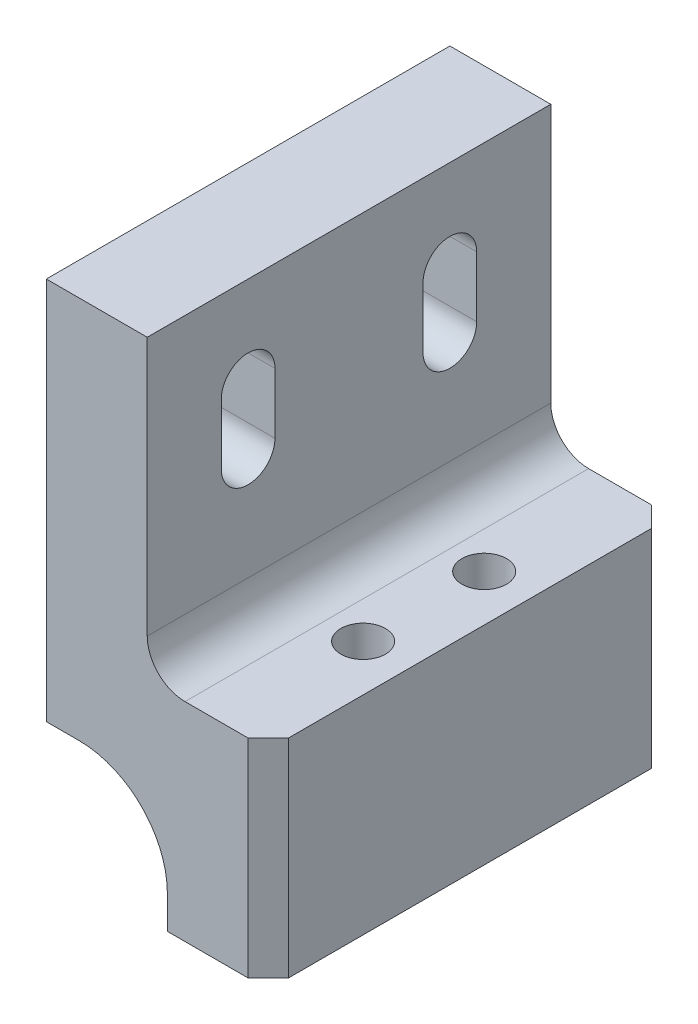
ISO-10303-21;
HEADER;
FILE_DESCRIPTION(('STEP AP214'),'2;1');
FILE_NAME('part.step','',(''),(''),'','','');
FILE_SCHEMA(('AUTOMOTIVE_DESIGN { 1 0 10303 214 1 1 1 1 }'));
ENDSEC;
DATA;
#1=APPLICATION_CONTEXT('core data for automotive mechanical design processes');
#2=APPLICATION_PROTOCOL_DEFINITION('international standard','automotive_design',2000,#1);
#3=PRODUCT_CONTEXT('',#1,'mechanical');
#4=PRODUCT('Part','Part','',(#3));
#5=PRODUCT_RELATED_PRODUCT_CATEGORY('part','',(#4));
#6=PRODUCT_DEFINITION_FORMATION('','',#4);
#7=PRODUCT_DEFINITION_CONTEXT('part definition',#1,'design');
#8=PRODUCT_DEFINITION('design','',#6,#7);
#9=PRODUCT_DEFINITION_SHAPE('','',#8);
#10=(LENGTH_UNIT() NAMED_UNIT(*) SI_UNIT(.MILLI.,.METRE.));
#11=(NAMED_UNIT(*) PLANE_ANGLE_UNIT() SI_UNIT($,.RADIAN.));
#12=(NAMED_UNIT(*) SI_UNIT($,.STERADIAN.) SOLID_ANGLE_UNIT());
#13=UNCERTAINTY_MEASURE_WITH_UNIT(LENGTH_MEASURE(1.E-05),#10,'distance_accuracy_value','');
#14=(GEOMETRIC_REPRESENTATION_CONTEXT(3) GLOBAL_UNCERTAINTY_ASSIGNED_CONTEXT((#13)) GLOBAL_UNIT_ASSIGNED_CONTEXT((#10,
#11,#12)) REPRESENTATION_CONTEXT('',''));
#15=CARTESIAN_POINT('',(0.,0.,0.));
#16=DIRECTION('',(0.,0.,1.));
#17=DIRECTION('',(1.,0.,0.));
#18=AXIS2_PLACEMENT_3D('',#15,#16,#17);
#19=CARTESIAN_POINT('',(27.94,31.7500000000001,-25.4));
#20=DIRECTION('',(0.,0.999999999999999,0.));
#21=DIRECTION('',(0.,0.,0.999999999999998));
#22=AXIS2_PLACEMENT_3D('',#19,#20,#21);
#23=PLANE('',#22);
#24=DIRECTION('',(0.,0.,0.999999999999998));
#25=VECTOR('',#24,1.);
#26=CARTESIAN_POINT('',(12.7,31.7500000000001,-25.4));
#27=LINE('',#26,#25);
#28=CARTESIAN_POINT('',(12.7,31.7500000000001,-25.4));
#29=VERTEX_POINT('',#28);
#30=CARTESIAN_POINT('',(12.7,31.75,25.3999999999997));
#31=VERTEX_POINT('',#30);
#32=EDGE_CURVE('E260',#29,#31,#27,.T.);
#33=ORIENTED_EDGE('',*,*,#32,.F.);
#34=DIRECTION('',(-1.,0.,0.));
#35=VECTOR('',#34,1.);
#36=CARTESIAN_POINT('',(27.94,31.7500000000001,-25.4));
#37=LINE('',#36,#35);
#38=CARTESIAN_POINT('',(0.,31.7499999999999,-25.4));
#39=VERTEX_POINT('',#38);
#40=EDGE_CURVE('E304',#29,#39,#37,.T.);
#41=ORIENTED_EDGE('',*,*,#40,.T.);
#42=DIRECTION('',(0.,0.,0.999999999999998));
#43=VECTOR('',#42,1.);
#44=CARTESIAN_POINT('',(0.,31.7499999999999,-25.4));
#45=LINE('',#44,#43);
#46=CARTESIAN_POINT('',(0.,31.75,25.3999999999997));
#47=VERTEX_POINT('',#46);
#48=EDGE_CURVE('E290',#39,#47,#45,.T.);
#49=ORIENTED_EDGE('',*,*,#48,.T.);
#50=DIRECTION('',(-1.,0.,0.));
#51=VECTOR('',#50,1.);
#52=CARTESIAN_POINT('',(27.94,31.75,25.3999999999997));
#53=LINE('',#52,#51);
#54=EDGE_CURVE('E300',#31,#47,#53,.T.);
#55=ORIENTED_EDGE('',*,*,#54,.F.);
#56=EDGE_LOOP('',(#33,#41,#49,#55));
#57=FACE_BOUND('',#56,.T.);
#58=ADVANCED_FACE('F34',(#57),#23,.T.);
#59=CARTESIAN_POINT('',(27.94,31.7500000000001,-25.4));
#60=DIRECTION('',(1.,0.,0.));
#61=DIRECTION('',(0.,0.999999999999999,0.));
#62=AXIS2_PLACEMENT_3D('',#59,#60,#61);
#63=PLANE('',#62);
#64=DIRECTION('',(0.,0.,0.999999999999998));
#65=VECTOR('',#64,1.);
#66=CARTESIAN_POINT('',(27.94,-5.58799999999995,-25.4));
#67=LINE('',#66,#65);
#68=CARTESIAN_POINT('',(27.94,-5.58799999999993,-22.86));
#69=VERTEX_POINT('',#68);
#70=CARTESIAN_POINT('',(27.94,-5.58799999999987,22.8599999999998));
#71=VERTEX_POINT('',#70);
#72=EDGE_CURVE('E255',#69,#71,#67,.T.);
#73=ORIENTED_EDGE('',*,*,#72,.T.);
#74=DIRECTION('',(0.,-0.999999999999999,0.));
#75=VECTOR('',#74,1.);
#76=CARTESIAN_POINT('',(27.94,-31.7499999999999,22.8599999999998));
#77=LINE('',#76,#75);
#78=CARTESIAN_POINT('',(27.94,-31.7499999999999,22.8599999999998));
#79=VERTEX_POINT('',#78);
#80=EDGE_CURVE('E55',#71,#79,#77,.T.);
#81=ORIENTED_EDGE('',*,*,#80,.T.);
#82=DIRECTION('',(0.,0.,0.999999999999998));
#83=VECTOR('',#82,1.);
#84=CARTESIAN_POINT('',(27.94,-31.7499999999999,-25.3999999999999));
#85=LINE('',#84,#83);
#86=CARTESIAN_POINT('',(27.94,-31.7499999999999,-22.86));
#87=VERTEX_POINT('',#86);
#88=EDGE_CURVE('E306',#87,#79,#85,.T.);
#89=ORIENTED_EDGE('',*,*,#88,.F.);
#90=DIRECTION('',(0.,0.999999999999999,0.));
#91=VECTOR('',#90,1.);
#92=CARTESIAN_POINT('',(27.94,31.7500000000001,-22.86));
#93=LINE('',#92,#91);
#94=EDGE_CURVE('E335',#87,#69,#93,.T.);
#95=ORIENTED_EDGE('',*,*,#94,.T.);
#96=EDGE_LOOP('',(#73,#81,#89,#95));
#97=FACE_BOUND('',#96,.T.);
#98=ADVANCED_FACE('F356',(#97),#63,.T.);
#99=CARTESIAN_POINT('',(27.94,-31.7499999999999,-25.3999999999999));
#100=DIRECTION('',(0.,-0.999999999999999,0.));
#101=DIRECTION('',(0.,0.,-0.999999999999998));
#102=AXIS2_PLACEMENT_3D('',#99,#100,#101);
#103=PLANE('',#102);
#104=CARTESIAN_POINT('',(22.098,-31.7499999999999,7.62000000000007));
#105=DIRECTION('',(0.,0.999999999999999,0.));
#106=DIRECTION('',(0.,0.,0.999999999999998));
#107=AXIS2_PLACEMENT_3D('',#104,#105,#106);
#108=CIRCLE('',#107,2.80669999999999);
#109=CARTESIAN_POINT('',(22.098,-31.7499999999999,10.4267));
#110=VERTEX_POINT('',#109);
#111=EDGE_CURVE('E267',#110,#110,#108,.T.);
#112=ORIENTED_EDGE('',*,*,#111,.T.);
#113=EDGE_LOOP('',(#112));
#114=FACE_BOUND('',#113,.T.);
#115=CARTESIAN_POINT('',(22.098,-31.7499999999999,-7.6199999999999));
#116=DIRECTION('',(0.,0.999999999999999,0.));
#117=DIRECTION('',(0.,0.,0.999999999999998));
#118=AXIS2_PLACEMENT_3D('',#115,#116,#117);
#119=CIRCLE('',#118,2.80669999999999);
#120=CARTESIAN_POINT('',(22.098,-31.7499999999999,-4.81329999999992));
#121=VERTEX_POINT('',#120);
#122=EDGE_CURVE('E270',#121,#121,#119,.T.);
#123=ORIENTED_EDGE('',*,*,#122,.T.);
#124=EDGE_LOOP('',(#123));
#125=FACE_BOUND('',#124,.T.);
#126=ORIENTED_EDGE('',*,*,#88,.T.);
#127=DIRECTION('',(-0.707106781186546,0.,0.707106781186548));
#128=VECTOR('',#127,1.);
#129=CARTESIAN_POINT('',(52.07,-31.75,-1.27000000000027));
#130=LINE('',#129,#128);
#131=CARTESIAN_POINT('',(25.4,-31.7499999999999,25.3999999999998));
#132=VERTEX_POINT('',#131);
#133=EDGE_CURVE('E42',#79,#132,#130,.T.);
#134=ORIENTED_EDGE('',*,*,#133,.T.);
#135=DIRECTION('',(1.,0.,0.));
#136=VECTOR('',#135,1.);
#137=CARTESIAN_POINT('',(27.94,-31.7499999999999,25.3999999999998));
#138=LINE('',#137,#136);
#139=CARTESIAN_POINT('',(15.24,-31.7499999999999,25.3999999999998));
#140=VERTEX_POINT('',#139);
#141=EDGE_CURVE('E293',#140,#132,#138,.T.);
#142=ORIENTED_EDGE('',*,*,#141,.F.);
#143=DIRECTION('',(0.,0.,0.999999999999998));
#144=VECTOR('',#143,1.);
#145=CARTESIAN_POINT('',(15.24,-31.7499999999999,-25.3999999999999));
#146=LINE('',#145,#144);
#147=CARTESIAN_POINT('',(15.24,-31.7499999999999,-25.3999999999999));
#148=VERTEX_POINT('',#147);
#149=EDGE_CURVE('E283',#148,#140,#146,.T.);
#150=ORIENTED_EDGE('',*,*,#149,.F.);
#151=DIRECTION('',(1.,0.,0.));
#152=VECTOR('',#151,1.);
#153=CARTESIAN_POINT('',(27.94,-31.7499999999999,-25.3999999999999));
#154=LINE('',#153,#152);
#155=CARTESIAN_POINT('',(25.4,-31.7499999999999,-25.3999999999999));
#156=VERTEX_POINT('',#155);
#157=EDGE_CURVE('E302',#148,#156,#154,.T.);
#158=ORIENTED_EDGE('',*,*,#157,.T.);
#159=DIRECTION('',(-0.707106781186549,0.,-0.707106781186545));
#160=VECTOR('',#159,1.);
#161=CARTESIAN_POINT('',(26.67,-31.7499999999999,-24.1299999999999));
#162=LINE('',#161,#160);
#163=EDGE_CURVE('E339',#156,#87,#162,.F.);
#164=ORIENTED_EDGE('',*,*,#163,.T.);
#165=EDGE_LOOP('',(#126,#134,#142,#150,#158,#164));
#166=FACE_BOUND('',#165,.T.);
#167=ADVANCED_FACE('F343',(#114,#125,#166),#103,.T.);
#168=CARTESIAN_POINT('',(-27.94,-31.7499999999999,-25.3999999999999));
#169=DIRECTION('',(0.,0.,-0.999999999999998));
#170=DIRECTION('',(-1.,0.,0.));
#171=AXIS2_PLACEMENT_3D('',#168,#169,#170);
#172=PLANE('',#171);
#173=DIRECTION('',(1.,0.,0.));
#174=VECTOR('',#173,1.);
#175=CARTESIAN_POINT('',(12.7,-5.58799999999995,-25.4));
#176=LINE('',#175,#174);
#177=CARTESIAN_POINT('',(17.4625,-5.58799999999995,-25.4));
#178=VERTEX_POINT('',#177);
#179=CARTESIAN_POINT('',(25.4,-5.58799999999995,-25.4));
#180=VERTEX_POINT('',#179);
#181=EDGE_CURVE('E252',#178,#180,#176,.T.);
#182=ORIENTED_EDGE('',*,*,#181,.T.);
#183=DIRECTION('',(0.,-0.999999999999999,0.));
#184=VECTOR('',#183,1.);
#185=CARTESIAN_POINT('',(25.4,-31.7499999999999,-25.3999999999999));
#186=LINE('',#185,#184);
#187=EDGE_CURVE('E11',#180,#156,#186,.T.);
#188=ORIENTED_EDGE('',*,*,#187,.T.);
#189=ORIENTED_EDGE('',*,*,#157,.F.);
#190=DIRECTION('',(0.,0.999999999999999,0.));
#191=VECTOR('',#190,1.);
#192=CARTESIAN_POINT('',(15.24,-31.7499999999999,-25.3999999999999));
#193=LINE('',#192,#191);
#194=CARTESIAN_POINT('',(15.24,-27.6224999999999,-25.3999999999999));
#195=VERTEX_POINT('',#194);
#196=EDGE_CURVE('E274',#148,#195,#193,.T.);
#197=ORIENTED_EDGE('',*,*,#196,.T.);
#198=CARTESIAN_POINT('',(4.12750000000001,-27.6225000000001,-25.4));
#199=DIRECTION('',(0.,0.,-0.999999999999998));
#200=DIRECTION('',(-1.,0.,0.));
#201=AXIS2_PLACEMENT_3D('',#198,#199,#200);
#202=CIRCLE('',#201,11.1125);
#203=CARTESIAN_POINT('',(4.12749999999994,-16.5100000000001,-25.4));
#204=VERTEX_POINT('',#203);
#205=EDGE_CURVE('E315',#195,#204,#202,.F.);
#206=ORIENTED_EDGE('',*,*,#205,.T.);
#207=DIRECTION('',(-1.,0.,0.));
#208=VECTOR('',#207,1.);
#209=CARTESIAN_POINT('',(15.2399999999999,-16.5099999999999,-25.4));
#210=LINE('',#209,#208);
#211=CARTESIAN_POINT('',(0.,-16.5100000000001,-25.4));
#212=VERTEX_POINT('',#211);
#213=EDGE_CURVE('E277',#204,#212,#210,.T.);
#214=ORIENTED_EDGE('',*,*,#213,.T.);
#215=DIRECTION('',(0.,0.999999999999999,0.));
#216=VECTOR('',#215,1.);
#217=CARTESIAN_POINT('',(0.,31.7499999999999,-25.4));
#218=LINE('',#217,#216);
#219=EDGE_CURVE('E280',#212,#39,#218,.T.);
#220=ORIENTED_EDGE('',*,*,#219,.T.);
#221=ORIENTED_EDGE('',*,*,#40,.F.);
#222=DIRECTION('',(0.,-0.999999999999999,0.));
#223=VECTOR('',#222,1.);
#224=CARTESIAN_POINT('',(12.7,31.7500000000001,-25.4));
#225=LINE('',#224,#223);
#226=CARTESIAN_POINT('',(12.7,-0.825499999999951,-25.4));
#227=VERTEX_POINT('',#226);
#228=EDGE_CURVE('E249',#29,#227,#225,.T.);
#229=ORIENTED_EDGE('',*,*,#228,.T.);
#230=CARTESIAN_POINT('',(17.4625,-0.825499999999951,-25.4));
#231=DIRECTION('',(0.,0.,-0.999999999999998));
#232=DIRECTION('',(-1.,0.,0.));
#233=AXIS2_PLACEMENT_3D('',#230,#231,#232);
#234=CIRCLE('',#233,4.7625);
#235=EDGE_CURVE('E326',#227,#178,#234,.F.);
#236=ORIENTED_EDGE('',*,*,#235,.T.);
#237=EDGE_LOOP('',(#182,#188,#189,#197,#206,#214,#220,#221,#229,#236));
#238=FACE_BOUND('',#237,.T.);
#239=ADVANCED_FACE('F362',(#238),#172,.T.);
#240=CARTESIAN_POINT('',(-27.94,-31.75,25.3999999999998));
#241=DIRECTION('',(0.,0.,-0.999999999999998));
#242=DIRECTION('',(-1.,0.,0.));
#243=AXIS2_PLACEMENT_3D('',#240,#241,#242);
#244=PLANE('',#243);
#245=ORIENTED_EDGE('',*,*,#141,.T.);
#246=DIRECTION('',(0.,0.999999999999999,0.));
#247=VECTOR('',#246,1.);
#248=CARTESIAN_POINT('',(25.4,-5.58799999999987,25.3999999999998));
#249=LINE('',#248,#247);
#250=CARTESIAN_POINT('',(25.4,-5.58799999999987,25.3999999999998));
#251=VERTEX_POINT('',#250);
#252=EDGE_CURVE('E328',#132,#251,#249,.T.);
#253=ORIENTED_EDGE('',*,*,#252,.T.);
#254=DIRECTION('',(1.,0.,0.));
#255=VECTOR('',#254,1.);
#256=CARTESIAN_POINT('',(12.7,-5.58799999999998,25.3999999999998));
#257=LINE('',#256,#255);
#258=CARTESIAN_POINT('',(17.4625,-5.58799999999987,25.3999999999998));
#259=VERTEX_POINT('',#258);
#260=EDGE_CURVE('E253',#259,#251,#257,.T.);
#261=ORIENTED_EDGE('',*,*,#260,.F.);
#262=CARTESIAN_POINT('',(17.4625,-0.825499999999868,25.3999999999998));
#263=DIRECTION('',(0.,0.,-0.999999999999998));
#264=DIRECTION('',(-1.,0.,0.));
#265=AXIS2_PLACEMENT_3D('',#262,#263,#264);
#266=CIRCLE('',#265,4.7625);
#267=CARTESIAN_POINT('',(12.7,-0.825499999999979,25.3999999999998));
#268=VERTEX_POINT('',#267);
#269=EDGE_CURVE('E324',#259,#268,#266,.T.);
#270=ORIENTED_EDGE('',*,*,#269,.T.);
#271=DIRECTION('',(0.,-0.999999999999999,0.));
#272=VECTOR('',#271,1.);
#273=CARTESIAN_POINT('',(12.7,31.75,25.3999999999997));
#274=LINE('',#273,#272);
#275=EDGE_CURVE('E242',#31,#268,#274,.T.);
#276=ORIENTED_EDGE('',*,*,#275,.F.);
#277=ORIENTED_EDGE('',*,*,#54,.T.);
#278=DIRECTION('',(0.,0.999999999999999,0.));
#279=VECTOR('',#278,1.);
#280=CARTESIAN_POINT('',(0.,31.75,25.3999999999997));
#281=LINE('',#280,#279);
#282=CARTESIAN_POINT('',(0.,-16.51,25.3999999999998));
#283=VERTEX_POINT('',#282);
#284=EDGE_CURVE('E278',#283,#47,#281,.T.);
#285=ORIENTED_EDGE('',*,*,#284,.F.);
#286=DIRECTION('',(-1.,0.,0.));
#287=VECTOR('',#286,1.);
#288=CARTESIAN_POINT('',(15.24,-16.5099999999999,25.3999999999998));
#289=LINE('',#288,#287);
#290=CARTESIAN_POINT('',(4.12749999999999,-16.51,25.3999999999998));
#291=VERTEX_POINT('',#290);
#292=EDGE_CURVE('E286',#291,#283,#289,.T.);
#293=ORIENTED_EDGE('',*,*,#292,.F.);
#294=CARTESIAN_POINT('',(4.12750000000008,-27.6225,25.3999999999998));
#295=DIRECTION('',(0.,0.,-0.999999999999998));
#296=DIRECTION('',(-1.,0.,0.));
#297=AXIS2_PLACEMENT_3D('',#294,#295,#296);
#298=CIRCLE('',#297,11.1125);
#299=CARTESIAN_POINT('',(15.24,-27.6224999999999,25.3999999999998));
#300=VERTEX_POINT('',#299);
#301=EDGE_CURVE('E313',#291,#300,#298,.T.);
#302=ORIENTED_EDGE('',*,*,#301,.T.);
#303=DIRECTION('',(0.,0.999999999999999,0.));
#304=VECTOR('',#303,1.);
#305=CARTESIAN_POINT('',(15.24,-31.7499999999999,25.3999999999998));
#306=LINE('',#305,#304);
#307=EDGE_CURVE('E273',#140,#300,#306,.T.);
#308=ORIENTED_EDGE('',*,*,#307,.F.);
#309=EDGE_LOOP('',(#245,#253,#261,#270,#276,#277,#285,#293,#302,#308));
#310=FACE_BOUND('',#309,.T.);
#311=ADVANCED_FACE('F349',(#310),#244,.F.);
#312=CARTESIAN_POINT('',(0.,31.7499999999999,-25.4));
#313=DIRECTION('',(1.,0.,0.));
#314=DIRECTION('',(0.,0.999999999999999,0.));
#315=AXIS2_PLACEMENT_3D('',#312,#313,#314);
#316=PLANE('',#315);
#317=DIRECTION('',(0.,0.999999999999999,0.));
#318=VECTOR('',#317,1.);
#319=CARTESIAN_POINT('',(0.,20.32,-16.0782));
#320=LINE('',#319,#318);
#321=CARTESIAN_POINT('',(0.,12.7,-16.0782));
#322=VERTEX_POINT('',#321);
#323=CARTESIAN_POINT('',(0.,20.32,-16.0782));
#324=VERTEX_POINT('',#323);
#325=EDGE_CURVE('E185',#322,#324,#320,.T.);
#326=ORIENTED_EDGE('',*,*,#325,.T.);
#327=CARTESIAN_POINT('',(0.,20.32,-12.7));
#328=DIRECTION('',(1.,0.,0.));
#329=DIRECTION('',(0.,0.,-0.999999999999998));
#330=AXIS2_PLACEMENT_3D('',#327,#328,#329);
#331=CIRCLE('',#330,3.3782);
#332=CARTESIAN_POINT('',(0.,20.32,-9.32179999999999));
#333=VERTEX_POINT('',#332);
#334=EDGE_CURVE('E177',#324,#333,#331,.T.);
#335=ORIENTED_EDGE('',*,*,#334,.T.);
#336=DIRECTION('',(0.,-0.999999999999999,0.));
#337=VECTOR('',#336,1.);
#338=CARTESIAN_POINT('',(0.,20.32,-9.32179999999999));
#339=LINE('',#338,#337);
#340=CARTESIAN_POINT('',(0.,12.7,-9.32179999999999));
#341=VERTEX_POINT('',#340);
#342=EDGE_CURVE('E189',#333,#341,#339,.T.);
#343=ORIENTED_EDGE('',*,*,#342,.T.);
#344=CARTESIAN_POINT('',(0.,12.7,-12.7));
#345=DIRECTION('',(1.,0.,0.));
#346=DIRECTION('',(0.,0.,-0.999999999999998));
#347=AXIS2_PLACEMENT_3D('',#344,#345,#346);
#348=CIRCLE('',#347,3.3782);
#349=EDGE_CURVE('E193',#341,#322,#348,.T.);
#350=ORIENTED_EDGE('',*,*,#349,.T.);
#351=EDGE_LOOP('',(#326,#335,#343,#350));
#352=FACE_BOUND('',#351,.T.);
#353=DIRECTION('',(0.,0.999999999999999,0.));
#354=VECTOR('',#353,1.);
#355=CARTESIAN_POINT('',(0.,20.32,9.32179999999999));
#356=LINE('',#355,#354);
#357=CARTESIAN_POINT('',(0.,12.7,9.32179999999999));
#358=VERTEX_POINT('',#357);
#359=CARTESIAN_POINT('',(0.,20.32,9.32179999999999));
#360=VERTEX_POINT('',#359);
#361=EDGE_CURVE('E227',#358,#360,#356,.T.);
#362=ORIENTED_EDGE('',*,*,#361,.T.);
#363=CARTESIAN_POINT('',(0.,20.32,12.6999999999998));
#364=DIRECTION('',(1.,0.,0.));
#365=DIRECTION('',(0.,0.,-0.999999999999998));
#366=AXIS2_PLACEMENT_3D('',#363,#364,#365);
#367=CIRCLE('',#366,3.3782);
#368=CARTESIAN_POINT('',(0.,20.32,16.0781999999998));
#369=VERTEX_POINT('',#368);
#370=EDGE_CURVE('E217',#360,#369,#367,.T.);
#371=ORIENTED_EDGE('',*,*,#370,.T.);
#372=DIRECTION('',(0.,-0.999999999999999,0.));
#373=VECTOR('',#372,1.);
#374=CARTESIAN_POINT('',(0.,20.32,16.0781999999998));
#375=LINE('',#374,#373);
#376=CARTESIAN_POINT('',(0.,12.7,16.0781999999998));
#377=VERTEX_POINT('',#376);
#378=EDGE_CURVE('E220',#369,#377,#375,.T.);
#379=ORIENTED_EDGE('',*,*,#378,.T.);
#380=CARTESIAN_POINT('',(0.,12.7,12.6999999999998));
#381=DIRECTION('',(1.,0.,0.));
#382=DIRECTION('',(0.,0.,-0.999999999999998));
#383=AXIS2_PLACEMENT_3D('',#380,#381,#382);
#384=CIRCLE('',#383,3.3782);
#385=EDGE_CURVE('E224',#377,#358,#384,.T.);
#386=ORIENTED_EDGE('',*,*,#385,.T.);
#387=EDGE_LOOP('',(#362,#371,#379,#386));
#388=FACE_BOUND('',#387,.T.);
#389=ORIENTED_EDGE('',*,*,#284,.T.);
#390=ORIENTED_EDGE('',*,*,#48,.F.);
#391=ORIENTED_EDGE('',*,*,#219,.F.);
#392=DIRECTION('',(0.,0.,0.999999999999998));
#393=VECTOR('',#392,1.);
#394=CARTESIAN_POINT('',(0.,-16.5100000000001,-25.4));
#395=LINE('',#394,#393);
#396=EDGE_CURVE('E294',#212,#283,#395,.T.);
#397=ORIENTED_EDGE('',*,*,#396,.T.);
#398=EDGE_LOOP('',(#389,#390,#391,#397));
#399=FACE_BOUND('',#398,.T.);
#400=ADVANCED_FACE('F195',(#352,#388,#399),#316,.F.);
#401=CARTESIAN_POINT('',(15.2399999999999,-16.5099999999999,-25.4));
#402=DIRECTION('',(0.,0.999999999999999,0.));
#403=DIRECTION('',(0.,0.,0.999999999999998));
#404=AXIS2_PLACEMENT_3D('',#401,#402,#403);
#405=PLANE('',#404);
#406=ORIENTED_EDGE('',*,*,#213,.F.);
#407=DIRECTION('',(0.,0.,0.999999999999998));
#408=VECTOR('',#407,1.);
#409=CARTESIAN_POINT('',(4.12749999999999,-16.51,25.3999999999998));
#410=LINE('',#409,#408);
#411=EDGE_CURVE('E308',#204,#291,#410,.T.);
#412=ORIENTED_EDGE('',*,*,#411,.T.);
#413=ORIENTED_EDGE('',*,*,#292,.T.);
#414=ORIENTED_EDGE('',*,*,#396,.F.);
#415=EDGE_LOOP('',(#406,#412,#413,#414));
#416=FACE_BOUND('',#415,.T.);
#417=ADVANCED_FACE('F382',(#416),#405,.F.);
#418=CARTESIAN_POINT('',(15.24,-31.7499999999999,-25.3999999999999));
#419=DIRECTION('',(1.,0.,0.));
#420=DIRECTION('',(0.,0.,-0.999999999999998));
#421=AXIS2_PLACEMENT_3D('',#418,#419,#420);
#422=PLANE('',#421);
#423=ORIENTED_EDGE('',*,*,#307,.T.);
#424=DIRECTION('',(0.,0.,0.999999999999998));
#425=VECTOR('',#424,1.);
#426=CARTESIAN_POINT('',(15.24,-27.6224999999999,-25.3999999999999));
#427=LINE('',#426,#425);
#428=EDGE_CURVE('E311',#300,#195,#427,.F.);
#429=ORIENTED_EDGE('',*,*,#428,.T.);
#430=ORIENTED_EDGE('',*,*,#196,.F.);
#431=ORIENTED_EDGE('',*,*,#149,.T.);
#432=EDGE_LOOP('',(#423,#429,#430,#431));
#433=FACE_BOUND('',#432,.T.);
#434=ADVANCED_FACE('F389',(#433),#422,.F.);
#435=CARTESIAN_POINT('',(4.12750000000001,-27.6225000000001,-25.4));
#436=DIRECTION('',(0.,0.,-0.999999999999998));
#437=DIRECTION('',(-1.,0.,0.));
#438=AXIS2_PLACEMENT_3D('',#435,#436,#437);
#439=CYLINDRICAL_SURFACE('',#438,11.1125);
#440=ORIENTED_EDGE('',*,*,#205,.F.);
#441=ORIENTED_EDGE('',*,*,#428,.F.);
#442=ORIENTED_EDGE('',*,*,#301,.F.);
#443=ORIENTED_EDGE('',*,*,#411,.F.);
#444=EDGE_LOOP('',(#440,#441,#442,#443));
#445=FACE_BOUND('',#444,.T.);
#446=ADVANCED_FACE('F386',(#445),#439,.F.);
#447=CARTESIAN_POINT('',(22.0979999999999,31.75,-7.61999999999996));
#448=DIRECTION('',(0.,0.999999999999999,0.));
#449=DIRECTION('',(0.,0.,0.999999999999998));
#450=AXIS2_PLACEMENT_3D('',#447,#448,#449);
#451=CYLINDRICAL_SURFACE('',#450,2.80669999999999);
#452=CARTESIAN_POINT('',(22.098,-5.58799999999984,-7.61999999999996));
#453=DIRECTION('',(0.,-0.999999999999999,0.));
#454=DIRECTION('',(0.,0.,-0.999999999999998));
#455=AXIS2_PLACEMENT_3D('',#452,#453,#454);
#456=CIRCLE('',#455,2.80669999999999);
#457=CARTESIAN_POINT('',(22.098,-5.58799999999984,-10.4266999999999));
#458=VERTEX_POINT('',#457);
#459=EDGE_CURVE('E264',#458,#458,#456,.F.);
#460=ORIENTED_EDGE('',*,*,#459,.T.);
#461=EDGE_LOOP('',(#460));
#462=FACE_BOUND('',#461,.T.);
#463=ORIENTED_EDGE('',*,*,#122,.F.);
#464=EDGE_LOOP('',(#463));
#465=FACE_BOUND('',#464,.T.);
#466=ADVANCED_FACE('F396',(#462,#465),#451,.F.);
#467=CARTESIAN_POINT('',(22.0979999999999,31.75,7.62000000000007));
#468=DIRECTION('',(0.,0.999999999999999,0.));
#469=DIRECTION('',(0.,0.,0.999999999999998));
#470=AXIS2_PLACEMENT_3D('',#467,#468,#469);
#471=CYLINDRICAL_SURFACE('',#470,2.80669999999999);
#472=CARTESIAN_POINT('',(22.098,-5.58799999999995,7.62000000000007));
#473=DIRECTION('',(0.,-0.999999999999999,0.));
#474=DIRECTION('',(0.,0.,-0.999999999999998));
#475=AXIS2_PLACEMENT_3D('',#472,#473,#474);
#476=CIRCLE('',#475,2.80669999999999);
#477=CARTESIAN_POINT('',(22.098,-5.58799999999995,4.81330000000009));
#478=VERTEX_POINT('',#477);
#479=EDGE_CURVE('E262',#478,#478,#476,.F.);
#480=ORIENTED_EDGE('',*,*,#479,.T.);
#481=EDGE_LOOP('',(#480));
#482=FACE_BOUND('',#481,.T.);
#483=ORIENTED_EDGE('',*,*,#111,.F.);
#484=EDGE_LOOP('',(#483));
#485=FACE_BOUND('',#484,.T.);
#486=ADVANCED_FACE('F447',(#482,#485),#471,.F.);
#487=CARTESIAN_POINT('',(12.7,-5.58799999999995,-25.4));
#488=DIRECTION('',(0.,-0.999999999999999,0.));
#489=DIRECTION('',(0.,0.,-0.999999999999998));
#490=AXIS2_PLACEMENT_3D('',#487,#488,#489);
#491=PLANE('',#490);
#492=ORIENTED_EDGE('',*,*,#479,.F.);
#493=EDGE_LOOP('',(#492));
#494=FACE_BOUND('',#493,.T.);
#495=ORIENTED_EDGE('',*,*,#260,.T.);
#496=DIRECTION('',(0.707106781186546,0.,-0.707106781186548));
#497=VECTOR('',#496,1.);
#498=CARTESIAN_POINT('',(25.4,-5.58799999999987,25.3999999999998));
#499=LINE('',#498,#497);
#500=EDGE_CURVE('E333',#251,#71,#499,.T.);
#501=ORIENTED_EDGE('',*,*,#500,.T.);
#502=ORIENTED_EDGE('',*,*,#72,.F.);
#503=DIRECTION('',(0.707106781186549,0.,0.707106781186545));
#504=VECTOR('',#503,1.);
#505=CARTESIAN_POINT('',(27.94,-5.58799999999993,-22.86));
#506=LINE('',#505,#504);
#507=EDGE_CURVE('E331',#69,#180,#506,.F.);
#508=ORIENTED_EDGE('',*,*,#507,.T.);
#509=ORIENTED_EDGE('',*,*,#181,.F.);
#510=DIRECTION('',(0.,0.,0.999999999999998));
#511=VECTOR('',#510,1.);
#512=CARTESIAN_POINT('',(17.4625,-5.58799999999987,25.3999999999998));
#513=LINE('',#512,#511);
#514=EDGE_CURVE('E317',#178,#259,#513,.T.);
#515=ORIENTED_EDGE('',*,*,#514,.T.);
#516=EDGE_LOOP('',(#495,#501,#502,#508,#509,#515));
#517=FACE_BOUND('',#516,.T.);
#518=ORIENTED_EDGE('',*,*,#459,.F.);
#519=EDGE_LOOP('',(#518));
#520=FACE_BOUND('',#519,.T.);
#521=ADVANCED_FACE('F354',(#494,#517,#520),#491,.F.);
#522=CARTESIAN_POINT('',(12.7,31.7500000000001,-25.4));
#523=DIRECTION('',(-1.,0.,0.));
#524=DIRECTION('',(0.,-0.999999999999999,0.));
#525=AXIS2_PLACEMENT_3D('',#522,#523,#524);
#526=PLANE('',#525);
#527=DIRECTION('',(0.,-0.999999999999999,0.));
#528=VECTOR('',#527,1.);
#529=CARTESIAN_POINT('',(12.7,20.3200000000001,-9.32179999999998));
#530=LINE('',#529,#528);
#531=CARTESIAN_POINT('',(12.7,20.3200000000001,-9.32179999999998));
#532=VERTEX_POINT('',#531);
#533=CARTESIAN_POINT('',(12.7000000000001,12.7000000000001,-9.32179999999998));
#534=VERTEX_POINT('',#533);
#535=EDGE_CURVE('E207',#532,#534,#530,.T.);
#536=ORIENTED_EDGE('',*,*,#535,.F.);
#537=CARTESIAN_POINT('',(12.7,20.3200000000001,-12.7));
#538=DIRECTION('',(1.,0.,0.));
#539=DIRECTION('',(0.,0.,-0.999999999999998));
#540=AXIS2_PLACEMENT_3D('',#537,#538,#539);
#541=CIRCLE('',#540,3.3782);
#542=CARTESIAN_POINT('',(12.7,20.3200000000001,-16.0782));
#543=VERTEX_POINT('',#542);
#544=EDGE_CURVE('E180',#543,#532,#541,.T.);
#545=ORIENTED_EDGE('',*,*,#544,.F.);
#546=DIRECTION('',(0.,0.999999999999999,0.));
#547=VECTOR('',#546,1.);
#548=CARTESIAN_POINT('',(12.7,20.3200000000001,-16.0782));
#549=LINE('',#548,#547);
#550=CARTESIAN_POINT('',(12.7,12.7000000000001,-16.0782));
#551=VERTEX_POINT('',#550);
#552=EDGE_CURVE('E198',#551,#543,#549,.T.);
#553=ORIENTED_EDGE('',*,*,#552,.F.);
#554=CARTESIAN_POINT('',(12.7,12.7000000000001,-12.7));
#555=DIRECTION('',(1.,0.,0.));
#556=DIRECTION('',(0.,0.,-0.999999999999998));
#557=AXIS2_PLACEMENT_3D('',#554,#555,#556);
#558=CIRCLE('',#557,3.3782);
#559=EDGE_CURVE('E201',#534,#551,#558,.T.);
#560=ORIENTED_EDGE('',*,*,#559,.F.);
#561=EDGE_LOOP('',(#536,#545,#553,#560));
#562=FACE_BOUND('',#561,.T.);
#563=DIRECTION('',(0.,-0.999999999999999,0.));
#564=VECTOR('',#563,1.);
#565=CARTESIAN_POINT('',(12.7,20.32,16.0781999999998));
#566=LINE('',#565,#564);
#567=CARTESIAN_POINT('',(12.7,20.32,16.0781999999998));
#568=VERTEX_POINT('',#567);
#569=CARTESIAN_POINT('',(12.7,12.7000000000002,16.0781999999998));
#570=VERTEX_POINT('',#569);
#571=EDGE_CURVE('E232',#568,#570,#566,.T.);
#572=ORIENTED_EDGE('',*,*,#571,.F.);
#573=CARTESIAN_POINT('',(12.7,20.3200000000001,12.6999999999998));
#574=DIRECTION('',(1.,0.,0.));
#575=DIRECTION('',(0.,0.,-0.999999999999998));
#576=AXIS2_PLACEMENT_3D('',#573,#574,#575);
#577=CIRCLE('',#576,3.3782);
#578=CARTESIAN_POINT('',(12.7000000000001,20.3200000000001,9.32179999999999));
#579=VERTEX_POINT('',#578);
#580=EDGE_CURVE('E213',#579,#568,#577,.T.);
#581=ORIENTED_EDGE('',*,*,#580,.F.);
#582=DIRECTION('',(0.,0.999999999999999,0.));
#583=VECTOR('',#582,1.);
#584=CARTESIAN_POINT('',(12.7000000000001,20.3200000000001,9.32179999999999));
#585=LINE('',#584,#583);
#586=CARTESIAN_POINT('',(12.7,12.7000000000002,9.32179999999999));
#587=VERTEX_POINT('',#586);
#588=EDGE_CURVE('E221',#587,#579,#585,.T.);
#589=ORIENTED_EDGE('',*,*,#588,.F.);
#590=CARTESIAN_POINT('',(12.7,12.7000000000002,12.6999999999998));
#591=DIRECTION('',(1.,0.,0.));
#592=DIRECTION('',(0.,0.,-0.999999999999998));
#593=AXIS2_PLACEMENT_3D('',#590,#591,#592);
#594=CIRCLE('',#593,3.3782);
#595=EDGE_CURVE('E235',#570,#587,#594,.T.);
#596=ORIENTED_EDGE('',*,*,#595,.F.);
#597=EDGE_LOOP('',(#572,#581,#589,#596));
#598=FACE_BOUND('',#597,.T.);
#599=ORIENTED_EDGE('',*,*,#275,.T.);
#600=DIRECTION('',(0.,0.,0.999999999999998));
#601=VECTOR('',#600,1.);
#602=CARTESIAN_POINT('',(12.7,-0.825499999999951,-25.4));
#603=LINE('',#602,#601);
#604=EDGE_CURVE('E322',#268,#227,#603,.F.);
#605=ORIENTED_EDGE('',*,*,#604,.T.);
#606=ORIENTED_EDGE('',*,*,#228,.F.);
#607=ORIENTED_EDGE('',*,*,#32,.T.);
#608=EDGE_LOOP('',(#599,#605,#606,#607));
#609=FACE_BOUND('',#608,.T.);
#610=ADVANCED_FACE('F371',(#562,#598,#609),#526,.F.);
#611=CARTESIAN_POINT('',(17.4625,-0.825499999999951,-25.4));
#612=DIRECTION('',(0.,0.,-0.999999999999998));
#613=DIRECTION('',(-1.,0.,0.));
#614=AXIS2_PLACEMENT_3D('',#611,#612,#613);
#615=CYLINDRICAL_SURFACE('',#614,4.7625);
#616=ORIENTED_EDGE('',*,*,#235,.F.);
#617=ORIENTED_EDGE('',*,*,#604,.F.);
#618=ORIENTED_EDGE('',*,*,#269,.F.);
#619=ORIENTED_EDGE('',*,*,#514,.F.);
#620=EDGE_LOOP('',(#616,#617,#618,#619));
#621=FACE_BOUND('',#620,.T.);
#622=ADVANCED_FACE('F367',(#621),#615,.F.);
#623=CARTESIAN_POINT('',(0.,20.32,12.6999999999998));
#624=DIRECTION('',(1.,0.,0.));
#625=DIRECTION('',(0.,0.,-0.999999999999998));
#626=AXIS2_PLACEMENT_3D('',#623,#624,#625);
#627=CYLINDRICAL_SURFACE('',#626,3.3782);
#628=ORIENTED_EDGE('',*,*,#580,.T.);
#629=DIRECTION('',(1.,0.,0.));
#630=VECTOR('',#629,1.);
#631=CARTESIAN_POINT('',(0.,20.32,16.0781999999998));
#632=LINE('',#631,#630);
#633=EDGE_CURVE('E230',#369,#568,#632,.T.);
#634=ORIENTED_EDGE('',*,*,#633,.F.);
#635=ORIENTED_EDGE('',*,*,#370,.F.);
#636=DIRECTION('',(1.,0.,0.));
#637=VECTOR('',#636,1.);
#638=CARTESIAN_POINT('',(0.,20.32,9.32179999999999));
#639=LINE('',#638,#637);
#640=EDGE_CURVE('E240',#360,#579,#639,.T.);
#641=ORIENTED_EDGE('',*,*,#640,.T.);
#642=EDGE_LOOP('',(#628,#634,#635,#641));
#643=FACE_BOUND('',#642,.T.);
#644=ADVANCED_FACE('F412',(#643),#627,.F.);
#645=CARTESIAN_POINT('',(0.,20.32,9.32179999999999));
#646=DIRECTION('',(0.,0.,-0.999999999999998));
#647=DIRECTION('',(-1.,0.,0.));
#648=AXIS2_PLACEMENT_3D('',#645,#646,#647);
#649=PLANE('',#648);
#650=ORIENTED_EDGE('',*,*,#588,.T.);
#651=ORIENTED_EDGE('',*,*,#640,.F.);
#652=ORIENTED_EDGE('',*,*,#361,.F.);
#653=DIRECTION('',(1.,0.,0.));
#654=VECTOR('',#653,1.);
#655=CARTESIAN_POINT('',(0.,12.7,9.32179999999999));
#656=LINE('',#655,#654);
#657=EDGE_CURVE('E243',#358,#587,#656,.T.);
#658=ORIENTED_EDGE('',*,*,#657,.T.);
#659=EDGE_LOOP('',(#650,#651,#652,#658));
#660=FACE_BOUND('',#659,.T.);
#661=ADVANCED_FACE('F431',(#660),#649,.F.);
#662=CARTESIAN_POINT('',(0.,12.7,12.6999999999998));
#663=DIRECTION('',(1.,0.,0.));
#664=DIRECTION('',(0.,0.,-0.999999999999998));
#665=AXIS2_PLACEMENT_3D('',#662,#663,#664);
#666=CYLINDRICAL_SURFACE('',#665,3.3782);
#667=ORIENTED_EDGE('',*,*,#595,.T.);
#668=ORIENTED_EDGE('',*,*,#657,.F.);
#669=ORIENTED_EDGE('',*,*,#385,.F.);
#670=DIRECTION('',(1.,0.,0.));
#671=VECTOR('',#670,1.);
#672=CARTESIAN_POINT('',(0.,12.7,16.0781999999998));
#673=LINE('',#672,#671);
#674=EDGE_CURVE('E245',#377,#570,#673,.T.);
#675=ORIENTED_EDGE('',*,*,#674,.T.);
#676=EDGE_LOOP('',(#667,#668,#669,#675));
#677=FACE_BOUND('',#676,.T.);
#678=ADVANCED_FACE('F434',(#677),#666,.F.);
#679=CARTESIAN_POINT('',(0.,20.32,16.0781999999998));
#680=DIRECTION('',(0.,0.,0.999999999999998));
#681=DIRECTION('',(1.,0.,0.));
#682=AXIS2_PLACEMENT_3D('',#679,#680,#681);
#683=PLANE('',#682);
#684=ORIENTED_EDGE('',*,*,#571,.T.);
#685=ORIENTED_EDGE('',*,*,#674,.F.);
#686=ORIENTED_EDGE('',*,*,#378,.F.);
#687=ORIENTED_EDGE('',*,*,#633,.T.);
#688=EDGE_LOOP('',(#684,#685,#686,#687));
#689=FACE_BOUND('',#688,.T.);
#690=ADVANCED_FACE('F430',(#689),#683,.F.);
#691=CARTESIAN_POINT('',(0.,20.32,-12.7));
#692=DIRECTION('',(1.,0.,0.));
#693=DIRECTION('',(0.,0.,-0.999999999999998));
#694=AXIS2_PLACEMENT_3D('',#691,#692,#693);
#695=CYLINDRICAL_SURFACE('',#694,3.3782);
#696=ORIENTED_EDGE('',*,*,#544,.T.);
#697=DIRECTION('',(1.,0.,0.));
#698=VECTOR('',#697,1.);
#699=CARTESIAN_POINT('',(0.,20.32,-9.32179999999999));
#700=LINE('',#699,#698);
#701=EDGE_CURVE('E173',#333,#532,#700,.T.);
#702=ORIENTED_EDGE('',*,*,#701,.F.);
#703=ORIENTED_EDGE('',*,*,#334,.F.);
#704=DIRECTION('',(1.,0.,0.));
#705=VECTOR('',#704,1.);
#706=CARTESIAN_POINT('',(0.,20.32,-16.0782));
#707=LINE('',#706,#705);
#708=EDGE_CURVE('E211',#324,#543,#707,.T.);
#709=ORIENTED_EDGE('',*,*,#708,.T.);
#710=EDGE_LOOP('',(#696,#702,#703,#709));
#711=FACE_BOUND('',#710,.T.);
#712=ADVANCED_FACE('F175',(#711),#695,.F.);
#713=CARTESIAN_POINT('',(0.,20.32,-16.0782));
#714=DIRECTION('',(0.,0.,-0.999999999999998));
#715=DIRECTION('',(-1.,0.,0.));
#716=AXIS2_PLACEMENT_3D('',#713,#714,#715);
#717=PLANE('',#716);
#718=ORIENTED_EDGE('',*,*,#552,.T.);
#719=ORIENTED_EDGE('',*,*,#708,.F.);
#720=ORIENTED_EDGE('',*,*,#325,.F.);
#721=DIRECTION('',(1.,0.,0.));
#722=VECTOR('',#721,1.);
#723=CARTESIAN_POINT('',(0.,12.7,-16.0782));
#724=LINE('',#723,#722);
#725=EDGE_CURVE('E214',#322,#551,#724,.T.);
#726=ORIENTED_EDGE('',*,*,#725,.T.);
#727=EDGE_LOOP('',(#718,#719,#720,#726));
#728=FACE_BOUND('',#727,.T.);
#729=ADVANCED_FACE('F423',(#728),#717,.F.);
#730=CARTESIAN_POINT('',(0.,12.7,-12.7));
#731=DIRECTION('',(1.,0.,0.));
#732=DIRECTION('',(0.,0.,-0.999999999999998));
#733=AXIS2_PLACEMENT_3D('',#730,#731,#732);
#734=CYLINDRICAL_SURFACE('',#733,3.3782);
#735=ORIENTED_EDGE('',*,*,#559,.T.);
#736=ORIENTED_EDGE('',*,*,#725,.F.);
#737=ORIENTED_EDGE('',*,*,#349,.F.);
#738=DIRECTION('',(1.,0.,0.));
#739=VECTOR('',#738,1.);
#740=CARTESIAN_POINT('',(0.,12.7,-9.32179999999999));
#741=LINE('',#740,#739);
#742=EDGE_CURVE('E184',#341,#534,#741,.T.);
#743=ORIENTED_EDGE('',*,*,#742,.T.);
#744=EDGE_LOOP('',(#735,#736,#737,#743));
#745=FACE_BOUND('',#744,.T.);
#746=ADVANCED_FACE('F418',(#745),#734,.F.);
#747=CARTESIAN_POINT('',(0.,20.32,-9.32179999999999));
#748=DIRECTION('',(0.,0.,0.999999999999998));
#749=DIRECTION('',(1.,0.,0.));
#750=AXIS2_PLACEMENT_3D('',#747,#748,#749);
#751=PLANE('',#750);
#752=ORIENTED_EDGE('',*,*,#535,.T.);
#753=ORIENTED_EDGE('',*,*,#742,.F.);
#754=ORIENTED_EDGE('',*,*,#342,.F.);
#755=ORIENTED_EDGE('',*,*,#701,.T.);
#756=EDGE_LOOP('',(#752,#753,#754,#755));
#757=FACE_BOUND('',#756,.T.);
#758=ADVANCED_FACE('F190',(#757),#751,.F.);
#759=CARTESIAN_POINT('',(25.4,-31.7499999999999,25.3999999999998));
#760=DIRECTION('',(0.707106781186549,0.,0.707106781186544));
#761=DIRECTION('',(0.707106781186546,0.,-0.707106781186548));
#762=AXIS2_PLACEMENT_3D('',#759,#760,#761);
#763=PLANE('',#762);
#764=ORIENTED_EDGE('',*,*,#133,.F.);
#765=ORIENTED_EDGE('',*,*,#80,.F.);
#766=ORIENTED_EDGE('',*,*,#500,.F.);
#767=ORIENTED_EDGE('',*,*,#252,.F.);
#768=EDGE_LOOP('',(#764,#765,#766,#767));
#769=FACE_BOUND('',#768,.T.);
#770=ADVANCED_FACE('F351',(#769),#763,.T.);
#771=CARTESIAN_POINT('',(27.94,31.7500000000001,-22.86));
#772=DIRECTION('',(-0.707106781186546,0.,0.707106781186548));
#773=DIRECTION('',(0.707106781186549,0.,0.707106781186545));
#774=AXIS2_PLACEMENT_3D('',#771,#772,#773);
#775=PLANE('',#774);
#776=ORIENTED_EDGE('',*,*,#163,.F.);
#777=ORIENTED_EDGE('',*,*,#187,.F.);
#778=ORIENTED_EDGE('',*,*,#507,.F.);
#779=ORIENTED_EDGE('',*,*,#94,.F.);
#780=EDGE_LOOP('',(#776,#777,#778,#779));
#781=FACE_BOUND('',#780,.T.);
#782=ADVANCED_FACE('F36',(#781),#775,.F.);
#783=CLOSED_SHELL('',(#58,#98,#167,#239,#311,#400,#417,#434,#446,#466,#486,#521,#610,#622,#644,
#661,#678,#690,#712,#729,#746,#758,#770,#782));
#784=MANIFOLD_SOLID_BREP('B2',#783);
#785=ADVANCED_BREP_SHAPE_REPRESENTATION('',(#18,#784),#14);
#786=SHAPE_DEFINITION_REPRESENTATION(#9,#785);
ENDSEC;
END-ISO-10303-21;
